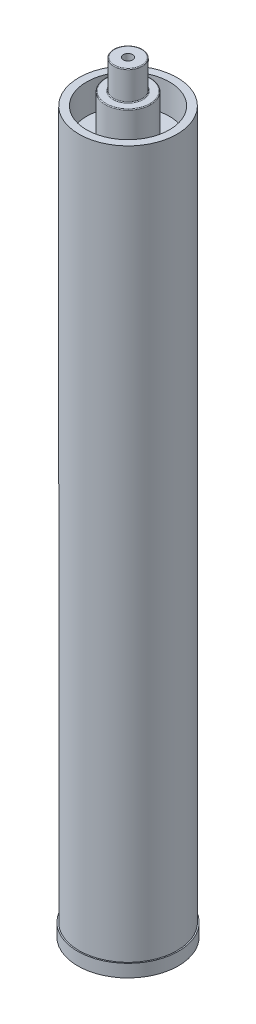
ISO-10303-21;
HEADER;
FILE_DESCRIPTION(('STEP AP214'),'2;1');
FILE_NAME('part.step','',(''),(''),'','','');
FILE_SCHEMA(('AUTOMOTIVE_DESIGN { 1 0 10303 214 1 1 1 1 }'));
ENDSEC;
DATA;
#1=APPLICATION_CONTEXT('core data for automotive mechanical design processes');
#2=APPLICATION_PROTOCOL_DEFINITION('international standard','automotive_design',2000,#1);
#3=PRODUCT_CONTEXT('',#1,'mechanical');
#4=PRODUCT('Part','Part','',(#3));
#5=PRODUCT_RELATED_PRODUCT_CATEGORY('part','',(#4));
#6=PRODUCT_DEFINITION_FORMATION('','',#4);
#7=PRODUCT_DEFINITION_CONTEXT('part definition',#1,'design');
#8=PRODUCT_DEFINITION('design','',#6,#7);
#9=PRODUCT_DEFINITION_SHAPE('','',#8);
#10=(LENGTH_UNIT() NAMED_UNIT(*) SI_UNIT(.MILLI.,.METRE.));
#11=(NAMED_UNIT(*) PLANE_ANGLE_UNIT() SI_UNIT($,.RADIAN.));
#12=(NAMED_UNIT(*) SI_UNIT($,.STERADIAN.) SOLID_ANGLE_UNIT());
#13=UNCERTAINTY_MEASURE_WITH_UNIT(LENGTH_MEASURE(1.E-05),#10,'distance_accuracy_value','');
#14=(GEOMETRIC_REPRESENTATION_CONTEXT(3) GLOBAL_UNCERTAINTY_ASSIGNED_CONTEXT((#13)) GLOBAL_UNIT_ASSIGNED_CONTEXT((#10,
#11,#12)) REPRESENTATION_CONTEXT('',''));
#15=CARTESIAN_POINT('',(0.,0.,0.));
#16=DIRECTION('',(0.,0.,1.));
#17=DIRECTION('',(1.,0.,0.));
#18=AXIS2_PLACEMENT_3D('',#15,#16,#17);
#19=CARTESIAN_POINT('',(0.,-72.1614,0.));
#20=DIRECTION('',(0.,-1.,0.));
#21=DIRECTION('',(0.,0.,-1.));
#22=AXIS2_PLACEMENT_3D('',#19,#20,#21);
#23=PLANE('',#22);
#24=CARTESIAN_POINT('',(0.,-72.1614,0.));
#25=DIRECTION('',(0.,-1.,0.));
#26=DIRECTION('',(0.,0.,-1.));
#27=AXIS2_PLACEMENT_3D('',#24,#25,#26);
#28=CIRCLE('',#27,23.4569);
#29=CARTESIAN_POINT('',(0.,-72.1614,-23.4569));
#30=VERTEX_POINT('',#29);
#31=EDGE_CURVE('E72',#30,#30,#28,.T.);
#32=ORIENTED_EDGE('',*,*,#31,.T.);
#33=EDGE_LOOP('',(#32));
#34=FACE_BOUND('',#33,.T.);
#35=CARTESIAN_POINT('',(0.,-72.1614,0.));
#36=DIRECTION('',(0.,1.,0.));
#37=DIRECTION('',(0.,0.,1.));
#38=AXIS2_PLACEMENT_3D('',#35,#36,#37);
#39=CIRCLE('',#38,41.6179);
#40=CARTESIAN_POINT('',(0.,-72.1614,41.6179));
#41=VERTEX_POINT('',#40);
#42=EDGE_CURVE('E82',#41,#41,#39,.T.);
#43=ORIENTED_EDGE('',*,*,#42,.T.);
#44=EDGE_LOOP('',(#43));
#45=FACE_BOUND('',#44,.T.);
#46=ADVANCED_FACE('F43',(#34,#45),#23,.F.);
#47=CARTESIAN_POINT('',(0.,-29.2608,0.));
#48=DIRECTION('',(0.,1.,0.));
#49=DIRECTION('',(0.,0.,1.));
#50=AXIS2_PLACEMENT_3D('',#47,#48,#49);
#51=CYLINDRICAL_SURFACE('',#50,14.351);
#52=CARTESIAN_POINT('',(0.,-28.4988,0.));
#53=DIRECTION('',(0.,-1.,0.));
#54=DIRECTION('',(0.,0.,-1.));
#55=AXIS2_PLACEMENT_3D('',#52,#53,#54);
#56=CIRCLE('',#55,14.351);
#57=CARTESIAN_POINT('',(0.,-28.4988,-14.351));
#58=VERTEX_POINT('',#57);
#59=EDGE_CURVE('E58',#58,#58,#56,.F.);
#60=ORIENTED_EDGE('',*,*,#59,.T.);
#61=EDGE_LOOP('',(#60));
#62=FACE_BOUND('',#61,.T.);
#63=CARTESIAN_POINT('',(0.,-0.761999999999999,0.));
#64=DIRECTION('',(0.,1.,0.));
#65=DIRECTION('',(0.,0.,1.));
#66=AXIS2_PLACEMENT_3D('',#63,#64,#65);
#67=CIRCLE('',#66,14.351);
#68=CARTESIAN_POINT('',(0.,-0.761999999999999,14.351));
#69=VERTEX_POINT('',#68);
#70=EDGE_CURVE('E63',#69,#69,#67,.F.);
#71=ORIENTED_EDGE('',*,*,#70,.T.);
#72=EDGE_LOOP('',(#71));
#73=FACE_BOUND('',#72,.T.);
#74=ADVANCED_FACE('F159',(#62,#73),#51,.T.);
#75=CARTESIAN_POINT('',(0.,0.,0.));
#76=DIRECTION('',(0.,1.,0.));
#77=DIRECTION('',(0.,0.,1.));
#78=AXIS2_PLACEMENT_3D('',#75,#76,#77);
#79=PLANE('',#78);
#80=CARTESIAN_POINT('',(0.,0.,0.));
#81=DIRECTION('',(0.,1.,0.));
#82=DIRECTION('',(0.,0.,1.));
#83=AXIS2_PLACEMENT_3D('',#80,#81,#82);
#84=CIRCLE('',#83,13.589);
#85=CARTESIAN_POINT('',(0.,0.,13.589));
#86=VERTEX_POINT('',#85);
#87=EDGE_CURVE('E11',#86,#86,#84,.T.);
#88=ORIENTED_EDGE('',*,*,#87,.T.);
#89=EDGE_LOOP('',(#88));
#90=FACE_BOUND('',#89,.T.);
#91=CARTESIAN_POINT('',(0.,0.,0.));
#92=DIRECTION('',(0.,1.,0.));
#93=DIRECTION('',(0.,0.,1.));
#94=AXIS2_PLACEMENT_3D('',#91,#92,#93);
#95=CIRCLE('',#94,4.64185);
#96=CARTESIAN_POINT('',(0.,0.,4.64185));
#97=VERTEX_POINT('',#96);
#98=EDGE_CURVE('E88',#97,#97,#95,.T.);
#99=ORIENTED_EDGE('',*,*,#98,.F.);
#100=EDGE_LOOP('',(#99));
#101=FACE_BOUND('',#100,.T.);
#102=ADVANCED_FACE('F165',(#90,#101),#79,.T.);
#103=CARTESIAN_POINT('',(0.,-72.1614,0.));
#104=DIRECTION('',(0.,1.,0.));
#105=DIRECTION('',(0.,0.,1.));
#106=AXIS2_PLACEMENT_3D('',#103,#104,#105);
#107=CYLINDRICAL_SURFACE('',#106,22.6949);
#108=CARTESIAN_POINT('',(0.,-71.3994,0.));
#109=DIRECTION('',(0.,-1.,0.));
#110=DIRECTION('',(0.,0.,-1.));
#111=AXIS2_PLACEMENT_3D('',#108,#109,#110);
#112=CIRCLE('',#111,22.6949);
#113=CARTESIAN_POINT('',(0.,-71.3994,-22.6949));
#114=VERTEX_POINT('',#113);
#115=EDGE_CURVE('E66',#114,#114,#112,.F.);
#116=ORIENTED_EDGE('',*,*,#115,.T.);
#117=EDGE_LOOP('',(#116));
#118=FACE_BOUND('',#117,.T.);
#119=CARTESIAN_POINT('',(0.,-30.0228,0.));
#120=DIRECTION('',(0.,-1.,0.));
#121=DIRECTION('',(0.,0.,-1.));
#122=AXIS2_PLACEMENT_3D('',#119,#120,#121);
#123=CIRCLE('',#122,22.6949);
#124=CARTESIAN_POINT('',(0.,-30.0228,-22.6949));
#125=VERTEX_POINT('',#124);
#126=EDGE_CURVE('E69',#125,#125,#123,.T.);
#127=ORIENTED_EDGE('',*,*,#126,.T.);
#128=EDGE_LOOP('',(#127));
#129=FACE_BOUND('',#128,.T.);
#130=ADVANCED_FACE('F182',(#118,#129),#107,.T.);
#131=CARTESIAN_POINT('',(0.,-29.2608,0.));
#132=DIRECTION('',(0.,-1.,0.));
#133=DIRECTION('',(0.,0.,-1.));
#134=AXIS2_PLACEMENT_3D('',#131,#132,#133);
#135=PLANE('',#134);
#136=CARTESIAN_POINT('',(0.,-29.2608,0.));
#137=DIRECTION('',(0.,-1.,0.));
#138=DIRECTION('',(0.,0.,-1.));
#139=AXIS2_PLACEMENT_3D('',#136,#137,#138);
#140=CIRCLE('',#139,15.113);
#141=CARTESIAN_POINT('',(0.,-29.2608,-15.113));
#142=VERTEX_POINT('',#141);
#143=EDGE_CURVE('E50',#142,#142,#140,.T.);
#144=ORIENTED_EDGE('',*,*,#143,.T.);
#145=EDGE_LOOP('',(#144));
#146=FACE_BOUND('',#145,.T.);
#147=CARTESIAN_POINT('',(0.,-29.2608,0.));
#148=DIRECTION('',(0.,-1.,0.));
#149=DIRECTION('',(0.,0.,-1.));
#150=AXIS2_PLACEMENT_3D('',#147,#148,#149);
#151=CIRCLE('',#150,21.9329);
#152=CARTESIAN_POINT('',(0.,-29.2608,-21.9329));
#153=VERTEX_POINT('',#152);
#154=EDGE_CURVE('E54',#153,#153,#151,.F.);
#155=ORIENTED_EDGE('',*,*,#154,.T.);
#156=EDGE_LOOP('',(#155));
#157=FACE_BOUND('',#156,.T.);
#158=ADVANCED_FACE('F179',(#146,#157),#135,.F.);
#159=CARTESIAN_POINT('',(0.,-42.2402,0.));
#160=DIRECTION('',(0.,1.,0.));
#161=DIRECTION('',(0.,0.,1.));
#162=AXIS2_PLACEMENT_3D('',#159,#160,#161);
#163=PLANE('',#162);
#164=CARTESIAN_POINT('',(0.,-42.2402,0.));
#165=DIRECTION('',(0.,1.,0.));
#166=DIRECTION('',(0.,0.,1.));
#167=AXIS2_PLACEMENT_3D('',#164,#165,#166);
#168=CIRCLE('',#167,49.2379);
#169=CARTESIAN_POINT('',(0.,-42.2402,49.2379));
#170=VERTEX_POINT('',#169);
#171=EDGE_CURVE('E78',#170,#170,#168,.T.);
#172=ORIENTED_EDGE('',*,*,#171,.T.);
#173=EDGE_LOOP('',(#172));
#174=FACE_BOUND('',#173,.T.);
#175=CARTESIAN_POINT('',(0.,-42.2402,0.));
#176=DIRECTION('',(0.,1.,0.));
#177=DIRECTION('',(0.,0.,1.));
#178=AXIS2_PLACEMENT_3D('',#175,#176,#177);
#179=CIRCLE('',#178,41.6179);
#180=CARTESIAN_POINT('',(0.,-42.2402,41.6179));
#181=VERTEX_POINT('',#180);
#182=EDGE_CURVE('E81',#181,#181,#179,.T.);
#183=ORIENTED_EDGE('',*,*,#182,.F.);
#184=EDGE_LOOP('',(#183));
#185=FACE_BOUND('',#184,.T.);
#186=ADVANCED_FACE('F171',(#174,#185),#163,.T.);
#187=CARTESIAN_POINT('',(0.,-42.2402,0.));
#188=DIRECTION('',(0.,-1.,0.));
#189=DIRECTION('',(0.,0.,-1.));
#190=AXIS2_PLACEMENT_3D('',#187,#188,#189);
#191=CYLINDRICAL_SURFACE('',#190,41.6179);
#192=ORIENTED_EDGE('',*,*,#182,.T.);
#193=EDGE_LOOP('',(#192));
#194=FACE_BOUND('',#193,.T.);
#195=ORIENTED_EDGE('',*,*,#42,.F.);
#196=EDGE_LOOP('',(#195));
#197=FACE_BOUND('',#196,.T.);
#198=ADVANCED_FACE('F177',(#194,#197),#191,.F.);
#199=CARTESIAN_POINT('',(0.,-751.8654,0.));
#200=DIRECTION('',(0.,1.,0.));
#201=DIRECTION('',(0.,0.,1.));
#202=AXIS2_PLACEMENT_3D('',#199,#200,#201);
#203=CYLINDRICAL_SURFACE('',#202,49.2379);
#204=CARTESIAN_POINT('',(0.,-751.8654,0.));
#205=DIRECTION('',(0.,-1.,0.));
#206=DIRECTION('',(0.,0.,-1.));
#207=AXIS2_PLACEMENT_3D('',#204,#205,#206);
#208=CIRCLE('',#207,49.2379);
#209=CARTESIAN_POINT('',(0.,-751.8654,-49.2379));
#210=VERTEX_POINT('',#209);
#211=EDGE_CURVE('E75',#210,#210,#208,.T.);
#212=ORIENTED_EDGE('',*,*,#211,.F.);
#213=EDGE_LOOP('',(#212));
#214=FACE_BOUND('',#213,.T.);
#215=ORIENTED_EDGE('',*,*,#171,.F.);
#216=EDGE_LOOP('',(#215));
#217=FACE_BOUND('',#216,.T.);
#218=ADVANCED_FACE('F173',(#214,#217),#203,.T.);
#219=CARTESIAN_POINT('',(0.,-74.99858,0.));
#220=DIRECTION('',(0.,1.,0.));
#221=DIRECTION('',(0.,0.,1.));
#222=AXIS2_PLACEMENT_3D('',#219,#220,#221);
#223=CYLINDRICAL_SURFACE('',#222,4.64185);
#224=CARTESIAN_POINT('',(0.,-74.99858,0.));
#225=DIRECTION('',(0.,1.,0.));
#226=DIRECTION('',(0.,0.,1.));
#227=AXIS2_PLACEMENT_3D('',#224,#225,#226);
#228=CIRCLE('',#227,4.64185);
#229=CARTESIAN_POINT('',(0.,-74.99858,4.64185));
#230=VERTEX_POINT('',#229);
#231=EDGE_CURVE('E85',#230,#230,#228,.T.);
#232=ORIENTED_EDGE('',*,*,#231,.F.);
#233=EDGE_LOOP('',(#232));
#234=FACE_BOUND('',#233,.T.);
#235=ORIENTED_EDGE('',*,*,#98,.T.);
#236=EDGE_LOOP('',(#235));
#237=FACE_BOUND('',#236,.T.);
#238=ADVANCED_FACE('F176',(#234,#237),#223,.F.);
#239=CARTESIAN_POINT('',(0.,-74.99858,0.));
#240=DIRECTION('',(0.,1.,0.));
#241=DIRECTION('',(0.,0.,1.));
#242=AXIS2_PLACEMENT_3D('',#239,#240,#241);
#243=PLANE('',#242);
#244=ORIENTED_EDGE('',*,*,#231,.T.);
#245=EDGE_LOOP('',(#244));
#246=FACE_BOUND('',#245,.T.);
#247=ADVANCED_FACE('F150',(#246),#243,.T.);
#248=CARTESIAN_POINT('',(0.,-764.5654,0.));
#249=DIRECTION('',(0.,1.,0.));
#250=DIRECTION('',(0.,0.,1.));
#251=AXIS2_PLACEMENT_3D('',#248,#249,#250);
#252=CYLINDRICAL_SURFACE('',#251,50.5079);
#253=CARTESIAN_POINT('',(0.,-764.5654,0.));
#254=DIRECTION('',(0.,-1.,0.));
#255=DIRECTION('',(0.,0.,-1.));
#256=AXIS2_PLACEMENT_3D('',#253,#254,#255);
#257=CIRCLE('',#256,50.5079);
#258=CARTESIAN_POINT('',(0.,-764.5654,-50.5079));
#259=VERTEX_POINT('',#258);
#260=EDGE_CURVE('E91',#259,#259,#257,.T.);
#261=ORIENTED_EDGE('',*,*,#260,.F.);
#262=EDGE_LOOP('',(#261));
#263=FACE_BOUND('',#262,.T.);
#264=CARTESIAN_POINT('',(0.,-751.8654,0.));
#265=DIRECTION('',(0.,-1.,0.));
#266=DIRECTION('',(0.,0.,-1.));
#267=AXIS2_PLACEMENT_3D('',#264,#265,#266);
#268=CIRCLE('',#267,50.5079);
#269=CARTESIAN_POINT('',(0.,-751.8654,-50.5079));
#270=VERTEX_POINT('',#269);
#271=EDGE_CURVE('E94',#270,#270,#268,.T.);
#272=ORIENTED_EDGE('',*,*,#271,.T.);
#273=EDGE_LOOP('',(#272));
#274=FACE_BOUND('',#273,.T.);
#275=ADVANCED_FACE('F145',(#263,#274),#252,.T.);
#276=CARTESIAN_POINT('',(0.,-764.5654,0.));
#277=DIRECTION('',(0.,-1.,0.));
#278=DIRECTION('',(0.,0.,-1.));
#279=AXIS2_PLACEMENT_3D('',#276,#277,#278);
#280=PLANE('',#279);
#281=CARTESIAN_POINT('',(0.,-764.5654,0.));
#282=DIRECTION('',(0.,-1.,0.));
#283=DIRECTION('',(0.,0.,-1.));
#284=AXIS2_PLACEMENT_3D('',#281,#282,#283);
#285=CIRCLE('',#284,44.621320206);
#286=CARTESIAN_POINT('',(0.,-764.5654,-44.621320206));
#287=VERTEX_POINT('',#286);
#288=EDGE_CURVE('E97',#287,#287,#285,.T.);
#289=ORIENTED_EDGE('',*,*,#288,.F.);
#290=EDGE_LOOP('',(#289));
#291=FACE_BOUND('',#290,.T.);
#292=ORIENTED_EDGE('',*,*,#260,.T.);
#293=EDGE_LOOP('',(#292));
#294=FACE_BOUND('',#293,.T.);
#295=ADVANCED_FACE('F129',(#291,#294),#280,.T.);
#296=CARTESIAN_POINT('',(0.,-751.8654,0.));
#297=DIRECTION('',(0.,-1.,0.));
#298=DIRECTION('',(0.,0.,-1.));
#299=AXIS2_PLACEMENT_3D('',#296,#297,#298);
#300=PLANE('',#299);
#301=ORIENTED_EDGE('',*,*,#211,.T.);
#302=EDGE_LOOP('',(#301));
#303=FACE_BOUND('',#302,.T.);
#304=ORIENTED_EDGE('',*,*,#271,.F.);
#305=EDGE_LOOP('',(#304));
#306=FACE_BOUND('',#305,.T.);
#307=ADVANCED_FACE('F122',(#303,#306),#300,.F.);
#308=CARTESIAN_POINT('',(0.,-747.837378846,0.));
#309=DIRECTION('',(0.,-1.,0.));
#310=DIRECTION('',(0.,0.,-1.));
#311=AXIS2_PLACEMENT_3D('',#308,#309,#310);
#312=PLANE('',#311);
#313=CARTESIAN_POINT('',(0.,-747.837378846,0.));
#314=DIRECTION('',(0.,-1.,0.));
#315=DIRECTION('',(0.,0.,-1.));
#316=AXIS2_PLACEMENT_3D('',#313,#314,#315);
#317=CIRCLE('',#316,38.900000051);
#318=CARTESIAN_POINT('',(0.,-747.837378846,-38.900000051));
#319=VERTEX_POINT('',#318);
#320=EDGE_CURVE('E102',#319,#319,#317,.T.);
#321=ORIENTED_EDGE('',*,*,#320,.T.);
#322=EDGE_LOOP('',(#321));
#323=FACE_BOUND('',#322,.T.);
#324=ADVANCED_FACE('F112',(#323),#312,.T.);
#325=CARTESIAN_POINT('',(0.,-747.837378846,0.));
#326=DIRECTION('',(0.,-1.,0.));
#327=DIRECTION('',(0.,0.,-1.));
#328=AXIS2_PLACEMENT_3D('',#325,#326,#327);
#329=CONICAL_SURFACE('',#328,38.900000051,0.329548201908258);
#330=ORIENTED_EDGE('',*,*,#320,.F.);
#331=EDGE_LOOP('',(#330));
#332=FACE_BOUND('',#331,.T.);
#333=ORIENTED_EDGE('',*,*,#288,.T.);
#334=EDGE_LOOP('',(#333));
#335=FACE_BOUND('',#334,.T.);
#336=ADVANCED_FACE('F121',(#332,#335),#329,.F.);
#337=CARTESIAN_POINT('',(0.,-71.3994,0.));
#338=DIRECTION('',(0.,-1.,0.));
#339=DIRECTION('',(0.,0.,-1.));
#340=AXIS2_PLACEMENT_3D('',#337,#338,#339);
#341=TOROIDAL_SURFACE('',#340,23.4569,0.762);
#342=ORIENTED_EDGE('',*,*,#115,.F.);
#343=EDGE_LOOP('',(#342));
#344=FACE_BOUND('',#343,.T.);
#345=ORIENTED_EDGE('',*,*,#31,.F.);
#346=EDGE_LOOP('',(#345));
#347=FACE_BOUND('',#346,.T.);
#348=ADVANCED_FACE('F127',(#344,#347),#341,.F.);
#349=CARTESIAN_POINT('',(0.,-28.4988,0.));
#350=DIRECTION('',(0.,-1.,0.));
#351=DIRECTION('',(0.,0.,-1.));
#352=AXIS2_PLACEMENT_3D('',#349,#350,#351);
#353=TOROIDAL_SURFACE('',#352,15.113,0.762);
#354=ORIENTED_EDGE('',*,*,#143,.F.);
#355=EDGE_LOOP('',(#354));
#356=FACE_BOUND('',#355,.T.);
#357=ORIENTED_EDGE('',*,*,#59,.F.);
#358=EDGE_LOOP('',(#357));
#359=FACE_BOUND('',#358,.T.);
#360=ADVANCED_FACE('F190',(#356,#359),#353,.F.);
#361=CARTESIAN_POINT('',(0.,-30.0228,0.));
#362=DIRECTION('',(0.,-1.,0.));
#363=DIRECTION('',(0.,0.,-1.));
#364=AXIS2_PLACEMENT_3D('',#361,#362,#363);
#365=TOROIDAL_SURFACE('',#364,21.9329,0.762);
#366=ORIENTED_EDGE('',*,*,#154,.F.);
#367=EDGE_LOOP('',(#366));
#368=FACE_BOUND('',#367,.T.);
#369=ORIENTED_EDGE('',*,*,#126,.F.);
#370=EDGE_LOOP('',(#369));
#371=FACE_BOUND('',#370,.T.);
#372=ADVANCED_FACE('F193',(#368,#371),#365,.T.);
#373=CARTESIAN_POINT('',(0.,-0.761999999999999,0.));
#374=DIRECTION('',(0.,1.,0.));
#375=DIRECTION('',(0.,0.,1.));
#376=AXIS2_PLACEMENT_3D('',#373,#374,#375);
#377=TOROIDAL_SURFACE('',#376,13.589,0.762);
#378=ORIENTED_EDGE('',*,*,#70,.F.);
#379=EDGE_LOOP('',(#378));
#380=FACE_BOUND('',#379,.T.);
#381=ORIENTED_EDGE('',*,*,#87,.F.);
#382=EDGE_LOOP('',(#381));
#383=FACE_BOUND('',#382,.T.);
#384=ADVANCED_FACE('F45',(#380,#383),#377,.T.);
#385=CLOSED_SHELL('',(#46,#74,#102,#130,#158,#186,#198,#218,#238,#247,#275,#295,#307,#324,#336,
#348,#360,#372,#384));
#386=MANIFOLD_SOLID_BREP('B2',#385);
#387=ADVANCED_BREP_SHAPE_REPRESENTATION('',(#18,#386),#14);
#388=SHAPE_DEFINITION_REPRESENTATION(#9,#387);
ENDSEC;
END-ISO-10303-21;
